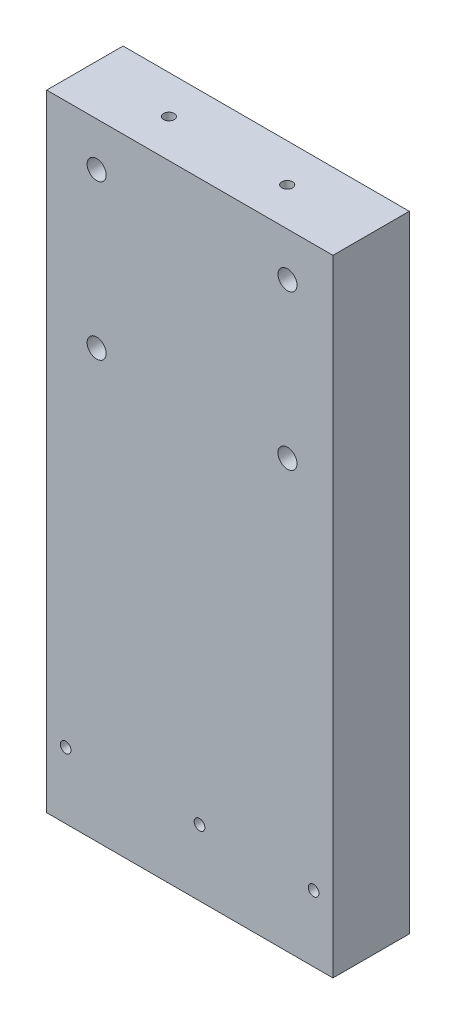
ISO-10303-21;
HEADER;
FILE_DESCRIPTION(('STEP AP214'),'2;1');
FILE_NAME('part.step','',(''),(''),'','','');
FILE_SCHEMA(('AUTOMOTIVE_DESIGN { 1 0 10303 214 1 1 1 1 }'));
ENDSEC;
DATA;
#1=APPLICATION_CONTEXT('core data for automotive mechanical design processes');
#2=APPLICATION_PROTOCOL_DEFINITION('international standard','automotive_design',2000,#1);
#3=PRODUCT_CONTEXT('',#1,'mechanical');
#4=PRODUCT('Part','Part','',(#3));
#5=PRODUCT_RELATED_PRODUCT_CATEGORY('part','',(#4));
#6=PRODUCT_DEFINITION_FORMATION('','',#4);
#7=PRODUCT_DEFINITION_CONTEXT('part definition',#1,'design');
#8=PRODUCT_DEFINITION('design','',#6,#7);
#9=PRODUCT_DEFINITION_SHAPE('','',#8);
#10=(LENGTH_UNIT() NAMED_UNIT(*) SI_UNIT(.MILLI.,.METRE.));
#11=(NAMED_UNIT(*) PLANE_ANGLE_UNIT() SI_UNIT($,.RADIAN.));
#12=(NAMED_UNIT(*) SI_UNIT($,.STERADIAN.) SOLID_ANGLE_UNIT());
#13=UNCERTAINTY_MEASURE_WITH_UNIT(LENGTH_MEASURE(1.E-05),#10,'distance_accuracy_value','');
#14=(GEOMETRIC_REPRESENTATION_CONTEXT(3) GLOBAL_UNCERTAINTY_ASSIGNED_CONTEXT((#13)) GLOBAL_UNIT_ASSIGNED_CONTEXT((#10,
#11,#12)) REPRESENTATION_CONTEXT('',''));
#15=CARTESIAN_POINT('',(0.,0.,0.));
#16=DIRECTION('',(0.,0.,1.));
#17=DIRECTION('',(1.,0.,0.));
#18=AXIS2_PLACEMENT_3D('',#15,#16,#17);
#19=CARTESIAN_POINT('',(0.,0.,20.));
#20=DIRECTION('',(0.,0.,1.));
#21=DIRECTION('',(1.,0.,0.));
#22=AXIS2_PLACEMENT_3D('',#19,#20,#21);
#23=PLANE('',#22);
#24=CARTESIAN_POINT('',(25.58376889492,70.5,20.));
#25=DIRECTION('',(0.,0.,1.));
#26=DIRECTION('',(1.,0.,0.));
#27=AXIS2_PLACEMENT_3D('',#24,#25,#26);
#28=CIRCLE('',#27,2.49999999999997);
#29=CARTESIAN_POINT('',(28.0837688949199,70.5,20.));
#30=VERTEX_POINT('',#29);
#31=EDGE_CURVE('E139',#30,#30,#28,.T.);
#32=ORIENTED_EDGE('',*,*,#31,.F.);
#33=EDGE_LOOP('',(#32));
#34=FACE_BOUND('',#33,.T.);
#35=CARTESIAN_POINT('',(25.58376889492,30.,20.));
#36=DIRECTION('',(0.,0.,1.));
#37=DIRECTION('',(1.,0.,0.));
#38=AXIS2_PLACEMENT_3D('',#35,#36,#37);
#39=CIRCLE('',#38,2.49999999999997);
#40=CARTESIAN_POINT('',(28.0837688949199,30.,20.));
#41=VERTEX_POINT('',#40);
#42=EDGE_CURVE('E127',#41,#41,#39,.T.);
#43=ORIENTED_EDGE('',*,*,#42,.F.);
#44=EDGE_LOOP('',(#43));
#45=FACE_BOUND('',#44,.T.);
#46=CARTESIAN_POINT('',(32.436706201269,-64.662730374622,20.));
#47=DIRECTION('',(0.,0.,1.));
#48=DIRECTION('',(1.,0.,0.));
#49=AXIS2_PLACEMENT_3D('',#46,#47,#48);
#50=CIRCLE('',#49,1.39999999999997);
#51=CARTESIAN_POINT('',(33.836706201269,-64.662730374622,20.));
#52=VERTEX_POINT('',#51);
#53=EDGE_CURVE('E115',#52,#52,#50,.T.);
#54=ORIENTED_EDGE('',*,*,#53,.F.);
#55=EDGE_LOOP('',(#54));
#56=FACE_BOUND('',#55,.T.);
#57=DIRECTION('',(1.,0.,0.));
#58=VECTOR('',#57,1.);
#59=CARTESIAN_POINT('',(-37.5,-82.,20.));
#60=LINE('',#59,#58);
#61=CARTESIAN_POINT('',(-37.5,-82.,20.));
#62=VERTEX_POINT('',#61);
#63=CARTESIAN_POINT('',(37.5,-82.,20.));
#64=VERTEX_POINT('',#63);
#65=EDGE_CURVE('E85',#62,#64,#60,.T.);
#66=ORIENTED_EDGE('',*,*,#65,.T.);
#67=DIRECTION('',(0.,1.,0.));
#68=VECTOR('',#67,1.);
#69=CARTESIAN_POINT('',(37.5,-82.,20.));
#70=LINE('',#69,#68);
#71=CARTESIAN_POINT('',(37.5,82.,20.));
#72=VERTEX_POINT('',#71);
#73=EDGE_CURVE('E80',#64,#72,#70,.T.);
#74=ORIENTED_EDGE('',*,*,#73,.T.);
#75=DIRECTION('',(-1.,0.,0.));
#76=VECTOR('',#75,1.);
#77=CARTESIAN_POINT('',(37.5,82.,20.));
#78=LINE('',#77,#76);
#79=CARTESIAN_POINT('',(-37.5,82.,20.));
#80=VERTEX_POINT('',#79);
#81=EDGE_CURVE('E83',#72,#80,#78,.T.);
#82=ORIENTED_EDGE('',*,*,#81,.T.);
#83=DIRECTION('',(0.,-1.,0.));
#84=VECTOR('',#83,1.);
#85=CARTESIAN_POINT('',(-37.5,82.,20.));
#86=LINE('',#85,#84);
#87=EDGE_CURVE('E50',#80,#62,#86,.T.);
#88=ORIENTED_EDGE('',*,*,#87,.T.);
#89=EDGE_LOOP('',(#66,#74,#82,#88));
#90=FACE_BOUND('',#89,.T.);
#91=CARTESIAN_POINT('',(-32.532413900171,-64.662730374622,20.));
#92=DIRECTION('',(0.,0.,1.));
#93=DIRECTION('',(1.,0.,0.));
#94=AXIS2_PLACEMENT_3D('',#91,#92,#93);
#95=CIRCLE('',#94,1.39999999999997);
#96=CARTESIAN_POINT('',(-31.1324139001711,-64.662730374622,20.));
#97=VERTEX_POINT('',#96);
#98=EDGE_CURVE('E100',#97,#97,#95,.T.);
#99=ORIENTED_EDGE('',*,*,#98,.F.);
#100=EDGE_LOOP('',(#99));
#101=FACE_BOUND('',#100,.T.);
#102=CARTESIAN_POINT('',(2.54199999999999,-64.662730374622,20.));
#103=DIRECTION('',(0.,0.,1.));
#104=DIRECTION('',(1.,0.,0.));
#105=AXIS2_PLACEMENT_3D('',#102,#103,#104);
#106=CIRCLE('',#105,1.40000000000001);
#107=CARTESIAN_POINT('',(3.94199999999999,-64.662730374622,20.));
#108=VERTEX_POINT('',#107);
#109=EDGE_CURVE('E121',#108,#108,#106,.T.);
#110=ORIENTED_EDGE('',*,*,#109,.F.);
#111=EDGE_LOOP('',(#110));
#112=FACE_BOUND('',#111,.T.);
#113=CARTESIAN_POINT('',(-24.41623110508,70.5,20.));
#114=DIRECTION('',(0.,0.,1.));
#115=DIRECTION('',(1.,0.,0.));
#116=AXIS2_PLACEMENT_3D('',#113,#114,#115);
#117=CIRCLE('',#116,2.5);
#118=CARTESIAN_POINT('',(-21.91623110508,70.5,20.));
#119=VERTEX_POINT('',#118);
#120=EDGE_CURVE('E133',#119,#119,#117,.T.);
#121=ORIENTED_EDGE('',*,*,#120,.F.);
#122=EDGE_LOOP('',(#121));
#123=FACE_BOUND('',#122,.T.);
#124=CARTESIAN_POINT('',(-24.41623110508,30.,20.));
#125=DIRECTION('',(0.,0.,1.));
#126=DIRECTION('',(1.,0.,0.));
#127=AXIS2_PLACEMENT_3D('',#124,#125,#126);
#128=CIRCLE('',#127,2.5);
#129=CARTESIAN_POINT('',(-21.91623110508,30.,20.));
#130=VERTEX_POINT('',#129);
#131=EDGE_CURVE('E145',#130,#130,#128,.T.);
#132=ORIENTED_EDGE('',*,*,#131,.F.);
#133=EDGE_LOOP('',(#132));
#134=FACE_BOUND('',#133,.T.);
#135=ADVANCED_FACE('F33',(#34,#45,#56,#90,#101,#112,#123,#134),#23,.T.);
#136=CARTESIAN_POINT('',(0.,0.,0.));
#137=DIRECTION('',(0.,0.,1.));
#138=DIRECTION('',(1.,0.,0.));
#139=AXIS2_PLACEMENT_3D('',#136,#137,#138);
#140=PLANE('',#139);
#141=DIRECTION('',(1.,0.,0.));
#142=VECTOR('',#141,1.);
#143=CARTESIAN_POINT('',(-37.5,-82.,0.));
#144=LINE('',#143,#142);
#145=CARTESIAN_POINT('',(-37.5,-82.,0.));
#146=VERTEX_POINT('',#145);
#147=CARTESIAN_POINT('',(37.5,-82.,0.));
#148=VERTEX_POINT('',#147);
#149=EDGE_CURVE('E97',#146,#148,#144,.T.);
#150=ORIENTED_EDGE('',*,*,#149,.F.);
#151=DIRECTION('',(0.,-1.,0.));
#152=VECTOR('',#151,1.);
#153=CARTESIAN_POINT('',(-37.5,82.,0.));
#154=LINE('',#153,#152);
#155=CARTESIAN_POINT('',(-37.5,82.,0.));
#156=VERTEX_POINT('',#155);
#157=EDGE_CURVE('E73',#156,#146,#154,.T.);
#158=ORIENTED_EDGE('',*,*,#157,.F.);
#159=DIRECTION('',(-1.,0.,0.));
#160=VECTOR('',#159,1.);
#161=CARTESIAN_POINT('',(37.5,82.,0.));
#162=LINE('',#161,#160);
#163=CARTESIAN_POINT('',(37.5,82.,0.));
#164=VERTEX_POINT('',#163);
#165=EDGE_CURVE('E67',#164,#156,#162,.T.);
#166=ORIENTED_EDGE('',*,*,#165,.F.);
#167=DIRECTION('',(0.,1.,0.));
#168=VECTOR('',#167,1.);
#169=CARTESIAN_POINT('',(37.5,-82.,0.));
#170=LINE('',#169,#168);
#171=EDGE_CURVE('E89',#148,#164,#170,.T.);
#172=ORIENTED_EDGE('',*,*,#171,.F.);
#173=EDGE_LOOP('',(#150,#158,#166,#172));
#174=FACE_BOUND('',#173,.T.);
#175=CARTESIAN_POINT('',(-32.532413900171,-64.662730374622,0.));
#176=DIRECTION('',(0.,0.,1.));
#177=DIRECTION('',(1.,0.,0.));
#178=AXIS2_PLACEMENT_3D('',#175,#176,#177);
#179=CIRCLE('',#178,1.39999999999997);
#180=CARTESIAN_POINT('',(-31.1324139001711,-64.662730374622,0.));
#181=VERTEX_POINT('',#180);
#182=EDGE_CURVE('E112',#181,#181,#179,.T.);
#183=ORIENTED_EDGE('',*,*,#182,.T.);
#184=EDGE_LOOP('',(#183));
#185=FACE_BOUND('',#184,.T.);
#186=CARTESIAN_POINT('',(32.436706201269,-64.662730374622,0.));
#187=DIRECTION('',(0.,0.,1.));
#188=DIRECTION('',(1.,0.,0.));
#189=AXIS2_PLACEMENT_3D('',#186,#187,#188);
#190=CIRCLE('',#189,1.39999999999997);
#191=CARTESIAN_POINT('',(33.836706201269,-64.662730374622,0.));
#192=VERTEX_POINT('',#191);
#193=EDGE_CURVE('E118',#192,#192,#190,.T.);
#194=ORIENTED_EDGE('',*,*,#193,.T.);
#195=EDGE_LOOP('',(#194));
#196=FACE_BOUND('',#195,.T.);
#197=CARTESIAN_POINT('',(2.54199999999999,-64.662730374622,0.));
#198=DIRECTION('',(0.,0.,1.));
#199=DIRECTION('',(1.,0.,0.));
#200=AXIS2_PLACEMENT_3D('',#197,#198,#199);
#201=CIRCLE('',#200,1.40000000000001);
#202=CARTESIAN_POINT('',(3.94199999999999,-64.662730374622,0.));
#203=VERTEX_POINT('',#202);
#204=EDGE_CURVE('E124',#203,#203,#201,.T.);
#205=ORIENTED_EDGE('',*,*,#204,.T.);
#206=EDGE_LOOP('',(#205));
#207=FACE_BOUND('',#206,.T.);
#208=CARTESIAN_POINT('',(25.58376889492,30.,0.));
#209=DIRECTION('',(0.,0.,1.));
#210=DIRECTION('',(1.,0.,0.));
#211=AXIS2_PLACEMENT_3D('',#208,#209,#210);
#212=CIRCLE('',#211,2.49999999999997);
#213=CARTESIAN_POINT('',(28.0837688949199,30.,0.));
#214=VERTEX_POINT('',#213);
#215=EDGE_CURVE('E130',#214,#214,#212,.T.);
#216=ORIENTED_EDGE('',*,*,#215,.T.);
#217=EDGE_LOOP('',(#216));
#218=FACE_BOUND('',#217,.T.);
#219=CARTESIAN_POINT('',(-24.41623110508,70.5,0.));
#220=DIRECTION('',(0.,0.,1.));
#221=DIRECTION('',(1.,0.,0.));
#222=AXIS2_PLACEMENT_3D('',#219,#220,#221);
#223=CIRCLE('',#222,2.5);
#224=CARTESIAN_POINT('',(-21.91623110508,70.5,0.));
#225=VERTEX_POINT('',#224);
#226=EDGE_CURVE('E136',#225,#225,#223,.T.);
#227=ORIENTED_EDGE('',*,*,#226,.T.);
#228=EDGE_LOOP('',(#227));
#229=FACE_BOUND('',#228,.T.);
#230=CARTESIAN_POINT('',(25.58376889492,70.5,0.));
#231=DIRECTION('',(0.,0.,1.));
#232=DIRECTION('',(1.,0.,0.));
#233=AXIS2_PLACEMENT_3D('',#230,#231,#232);
#234=CIRCLE('',#233,2.49999999999997);
#235=CARTESIAN_POINT('',(28.0837688949199,70.5,0.));
#236=VERTEX_POINT('',#235);
#237=EDGE_CURVE('E142',#236,#236,#234,.T.);
#238=ORIENTED_EDGE('',*,*,#237,.T.);
#239=EDGE_LOOP('',(#238));
#240=FACE_BOUND('',#239,.T.);
#241=CARTESIAN_POINT('',(-24.41623110508,30.,0.));
#242=DIRECTION('',(0.,0.,1.));
#243=DIRECTION('',(1.,0.,0.));
#244=AXIS2_PLACEMENT_3D('',#241,#242,#243);
#245=CIRCLE('',#244,2.5);
#246=CARTESIAN_POINT('',(-21.91623110508,30.,0.));
#247=VERTEX_POINT('',#246);
#248=EDGE_CURVE('E148',#247,#247,#245,.T.);
#249=ORIENTED_EDGE('',*,*,#248,.T.);
#250=EDGE_LOOP('',(#249));
#251=FACE_BOUND('',#250,.T.);
#252=ADVANCED_FACE('F108',(#174,#185,#196,#207,#218,#229,#240,#251),#140,.F.);
#253=CARTESIAN_POINT('',(-37.5,-82.,20.));
#254=DIRECTION('',(0.,1.,0.));
#255=DIRECTION('',(0.,0.,1.));
#256=AXIS2_PLACEMENT_3D('',#253,#254,#255);
#257=PLANE('',#256);
#258=CARTESIAN_POINT('',(-15.4901108770323,-82.,9.99503821497925));
#259=DIRECTION('',(0.,1.,0.));
#260=DIRECTION('',(0.,0.,1.));
#261=AXIS2_PLACEMENT_3D('',#258,#259,#260);
#262=CIRCLE('',#261,1.40000000000001);
#263=CARTESIAN_POINT('',(-15.4901108770323,-82.,11.3950382149793));
#264=VERTEX_POINT('',#263);
#265=EDGE_CURVE('E151',#264,#264,#262,.T.);
#266=ORIENTED_EDGE('',*,*,#265,.T.);
#267=EDGE_LOOP('',(#266));
#268=FACE_BOUND('',#267,.T.);
#269=CARTESIAN_POINT('',(15.5098891229677,-82.,9.99503821497925));
#270=DIRECTION('',(0.,1.,0.));
#271=DIRECTION('',(0.,0.,1.));
#272=AXIS2_PLACEMENT_3D('',#269,#270,#271);
#273=CIRCLE('',#272,1.4);
#274=CARTESIAN_POINT('',(15.5098891229677,-82.,11.3950382149792));
#275=VERTEX_POINT('',#274);
#276=EDGE_CURVE('E157',#275,#275,#273,.T.);
#277=ORIENTED_EDGE('',*,*,#276,.T.);
#278=EDGE_LOOP('',(#277));
#279=FACE_BOUND('',#278,.T.);
#280=ORIENTED_EDGE('',*,*,#149,.T.);
#281=DIRECTION('',(0.,0.,-1.));
#282=VECTOR('',#281,1.);
#283=CARTESIAN_POINT('',(37.5,-82.,20.));
#284=LINE('',#283,#282);
#285=EDGE_CURVE('E11',#64,#148,#284,.T.);
#286=ORIENTED_EDGE('',*,*,#285,.F.);
#287=ORIENTED_EDGE('',*,*,#65,.F.);
#288=DIRECTION('',(0.,0.,-1.));
#289=VECTOR('',#288,1.);
#290=CARTESIAN_POINT('',(-37.5,-82.,20.));
#291=LINE('',#290,#289);
#292=EDGE_CURVE('E93',#62,#146,#291,.T.);
#293=ORIENTED_EDGE('',*,*,#292,.T.);
#294=EDGE_LOOP('',(#280,#286,#287,#293));
#295=FACE_BOUND('',#294,.T.);
#296=ADVANCED_FACE('F35',(#268,#279,#295),#257,.F.);
#297=CARTESIAN_POINT('',(37.5,-82.,20.));
#298=DIRECTION('',(-1.,0.,0.));
#299=DIRECTION('',(0.,0.,1.));
#300=AXIS2_PLACEMENT_3D('',#297,#298,#299);
#301=PLANE('',#300);
#302=ORIENTED_EDGE('',*,*,#171,.T.);
#303=DIRECTION('',(0.,0.,-1.));
#304=VECTOR('',#303,1.);
#305=CARTESIAN_POINT('',(37.5,82.,20.));
#306=LINE('',#305,#304);
#307=EDGE_CURVE('E42',#72,#164,#306,.T.);
#308=ORIENTED_EDGE('',*,*,#307,.F.);
#309=ORIENTED_EDGE('',*,*,#73,.F.);
#310=ORIENTED_EDGE('',*,*,#285,.T.);
#311=EDGE_LOOP('',(#302,#308,#309,#310));
#312=FACE_BOUND('',#311,.T.);
#313=ADVANCED_FACE('F88',(#312),#301,.F.);
#314=CARTESIAN_POINT('',(37.5,82.,20.));
#315=DIRECTION('',(0.,-1.,0.));
#316=DIRECTION('',(0.,0.,-1.));
#317=AXIS2_PLACEMENT_3D('',#314,#315,#316);
#318=PLANE('',#317);
#319=CARTESIAN_POINT('',(-15.4901108770323,82.,9.99503821497925));
#320=DIRECTION('',(0.,1.,0.));
#321=DIRECTION('',(0.,0.,1.));
#322=AXIS2_PLACEMENT_3D('',#319,#320,#321);
#323=CIRCLE('',#322,1.40000000000001);
#324=CARTESIAN_POINT('',(-15.4901108770323,82.,11.3950382149793));
#325=VERTEX_POINT('',#324);
#326=EDGE_CURVE('E160',#325,#325,#323,.T.);
#327=ORIENTED_EDGE('',*,*,#326,.F.);
#328=EDGE_LOOP('',(#327));
#329=FACE_BOUND('',#328,.T.);
#330=CARTESIAN_POINT('',(15.5098891229677,82.,9.99503821497925));
#331=DIRECTION('',(0.,1.,0.));
#332=DIRECTION('',(0.,0.,1.));
#333=AXIS2_PLACEMENT_3D('',#330,#331,#332);
#334=CIRCLE('',#333,1.4);
#335=CARTESIAN_POINT('',(15.5098891229677,82.,11.3950382149792));
#336=VERTEX_POINT('',#335);
#337=EDGE_CURVE('E154',#336,#336,#334,.T.);
#338=ORIENTED_EDGE('',*,*,#337,.F.);
#339=EDGE_LOOP('',(#338));
#340=FACE_BOUND('',#339,.T.);
#341=ORIENTED_EDGE('',*,*,#165,.T.);
#342=DIRECTION('',(0.,0.,-1.));
#343=VECTOR('',#342,1.);
#344=CARTESIAN_POINT('',(-37.5,82.,20.));
#345=LINE('',#344,#343);
#346=EDGE_CURVE('E90',#80,#156,#345,.T.);
#347=ORIENTED_EDGE('',*,*,#346,.F.);
#348=ORIENTED_EDGE('',*,*,#81,.F.);
#349=ORIENTED_EDGE('',*,*,#307,.T.);
#350=EDGE_LOOP('',(#341,#347,#348,#349));
#351=FACE_BOUND('',#350,.T.);
#352=ADVANCED_FACE('F91',(#329,#340,#351),#318,.F.);
#353=CARTESIAN_POINT('',(-37.5,82.,20.));
#354=DIRECTION('',(1.,0.,0.));
#355=DIRECTION('',(0.,0.,-1.));
#356=AXIS2_PLACEMENT_3D('',#353,#354,#355);
#357=PLANE('',#356);
#358=ORIENTED_EDGE('',*,*,#157,.T.);
#359=ORIENTED_EDGE('',*,*,#292,.F.);
#360=ORIENTED_EDGE('',*,*,#87,.F.);
#361=ORIENTED_EDGE('',*,*,#346,.T.);
#362=EDGE_LOOP('',(#358,#359,#360,#361));
#363=FACE_BOUND('',#362,.T.);
#364=ADVANCED_FACE('F105',(#363),#357,.F.);
#365=CARTESIAN_POINT('',(-32.532413900171,-64.662730374622,20.));
#366=DIRECTION('',(0.,0.,-1.));
#367=DIRECTION('',(-1.,0.,0.));
#368=AXIS2_PLACEMENT_3D('',#365,#366,#367);
#369=CYLINDRICAL_SURFACE('',#368,1.39999999999997);
#370=ORIENTED_EDGE('',*,*,#98,.T.);
#371=EDGE_LOOP('',(#370));
#372=FACE_BOUND('',#371,.T.);
#373=ORIENTED_EDGE('',*,*,#182,.F.);
#374=EDGE_LOOP('',(#373));
#375=FACE_BOUND('',#374,.T.);
#376=ADVANCED_FACE('F201',(#372,#375),#369,.F.);
#377=CARTESIAN_POINT('',(32.436706201269,-64.662730374622,20.));
#378=DIRECTION('',(0.,0.,-1.));
#379=DIRECTION('',(-1.,0.,0.));
#380=AXIS2_PLACEMENT_3D('',#377,#378,#379);
#381=CYLINDRICAL_SURFACE('',#380,1.39999999999997);
#382=ORIENTED_EDGE('',*,*,#53,.T.);
#383=EDGE_LOOP('',(#382));
#384=FACE_BOUND('',#383,.T.);
#385=ORIENTED_EDGE('',*,*,#193,.F.);
#386=EDGE_LOOP('',(#385));
#387=FACE_BOUND('',#386,.T.);
#388=ADVANCED_FACE('F239',(#384,#387),#381,.F.);
#389=CARTESIAN_POINT('',(2.54199999999999,-64.662730374622,20.));
#390=DIRECTION('',(0.,0.,-1.));
#391=DIRECTION('',(-1.,0.,0.));
#392=AXIS2_PLACEMENT_3D('',#389,#390,#391);
#393=CYLINDRICAL_SURFACE('',#392,1.40000000000001);
#394=ORIENTED_EDGE('',*,*,#109,.T.);
#395=EDGE_LOOP('',(#394));
#396=FACE_BOUND('',#395,.T.);
#397=ORIENTED_EDGE('',*,*,#204,.F.);
#398=EDGE_LOOP('',(#397));
#399=FACE_BOUND('',#398,.T.);
#400=ADVANCED_FACE('F248',(#396,#399),#393,.F.);
#401=CARTESIAN_POINT('',(25.58376889492,30.,20.));
#402=DIRECTION('',(0.,0.,-1.));
#403=DIRECTION('',(-1.,0.,0.));
#404=AXIS2_PLACEMENT_3D('',#401,#402,#403);
#405=CYLINDRICAL_SURFACE('',#404,2.49999999999997);
#406=ORIENTED_EDGE('',*,*,#42,.T.);
#407=EDGE_LOOP('',(#406));
#408=FACE_BOUND('',#407,.T.);
#409=ORIENTED_EDGE('',*,*,#215,.F.);
#410=EDGE_LOOP('',(#409));
#411=FACE_BOUND('',#410,.T.);
#412=ADVANCED_FACE('F257',(#408,#411),#405,.F.);
#413=CARTESIAN_POINT('',(-24.41623110508,70.5,20.));
#414=DIRECTION('',(0.,0.,-1.));
#415=DIRECTION('',(-1.,0.,0.));
#416=AXIS2_PLACEMENT_3D('',#413,#414,#415);
#417=CYLINDRICAL_SURFACE('',#416,2.5);
#418=ORIENTED_EDGE('',*,*,#120,.T.);
#419=EDGE_LOOP('',(#418));
#420=FACE_BOUND('',#419,.T.);
#421=ORIENTED_EDGE('',*,*,#226,.F.);
#422=EDGE_LOOP('',(#421));
#423=FACE_BOUND('',#422,.T.);
#424=ADVANCED_FACE('F267',(#420,#423),#417,.F.);
#425=CARTESIAN_POINT('',(25.58376889492,70.5,20.));
#426=DIRECTION('',(0.,0.,-1.));
#427=DIRECTION('',(-1.,0.,0.));
#428=AXIS2_PLACEMENT_3D('',#425,#426,#427);
#429=CYLINDRICAL_SURFACE('',#428,2.49999999999997);
#430=ORIENTED_EDGE('',*,*,#31,.T.);
#431=EDGE_LOOP('',(#430));
#432=FACE_BOUND('',#431,.T.);
#433=ORIENTED_EDGE('',*,*,#237,.F.);
#434=EDGE_LOOP('',(#433));
#435=FACE_BOUND('',#434,.T.);
#436=ADVANCED_FACE('F187',(#432,#435),#429,.F.);
#437=CARTESIAN_POINT('',(-24.41623110508,30.,20.));
#438=DIRECTION('',(0.,0.,-1.));
#439=DIRECTION('',(-1.,0.,0.));
#440=AXIS2_PLACEMENT_3D('',#437,#438,#439);
#441=CYLINDRICAL_SURFACE('',#440,2.5);
#442=ORIENTED_EDGE('',*,*,#131,.T.);
#443=EDGE_LOOP('',(#442));
#444=FACE_BOUND('',#443,.T.);
#445=ORIENTED_EDGE('',*,*,#248,.F.);
#446=EDGE_LOOP('',(#445));
#447=FACE_BOUND('',#446,.T.);
#448=ADVANCED_FACE('F181',(#444,#447),#441,.F.);
#449=CARTESIAN_POINT('',(15.5098891229677,-82.,9.99503821497925));
#450=DIRECTION('',(0.,1.,0.));
#451=DIRECTION('',(0.,0.,1.));
#452=AXIS2_PLACEMENT_3D('',#449,#450,#451);
#453=CYLINDRICAL_SURFACE('',#452,1.4);
#454=ORIENTED_EDGE('',*,*,#276,.F.);
#455=EDGE_LOOP('',(#454));
#456=FACE_BOUND('',#455,.T.);
#457=ORIENTED_EDGE('',*,*,#337,.T.);
#458=EDGE_LOOP('',(#457));
#459=FACE_BOUND('',#458,.T.);
#460=ADVANCED_FACE('F171',(#456,#459),#453,.F.);
#461=CARTESIAN_POINT('',(-15.4901108770323,-82.,9.99503821497925));
#462=DIRECTION('',(0.,1.,0.));
#463=DIRECTION('',(0.,0.,1.));
#464=AXIS2_PLACEMENT_3D('',#461,#462,#463);
#465=CYLINDRICAL_SURFACE('',#464,1.40000000000001);
#466=ORIENTED_EDGE('',*,*,#265,.F.);
#467=EDGE_LOOP('',(#466));
#468=FACE_BOUND('',#467,.T.);
#469=ORIENTED_EDGE('',*,*,#326,.T.);
#470=EDGE_LOOP('',(#469));
#471=FACE_BOUND('',#470,.T.);
#472=ADVANCED_FACE('F168',(#468,#471),#465,.F.);
#473=CLOSED_SHELL('',(#135,#252,#296,#313,#352,#364,#376,#388,#400,#412,#424,#436,#448,#460,#472));
#474=MANIFOLD_SOLID_BREP('B2',#473);
#475=ADVANCED_BREP_SHAPE_REPRESENTATION('',(#18,#474),#14);
#476=SHAPE_DEFINITION_REPRESENTATION(#9,#475);
ENDSEC;
END-ISO-10303-21;
